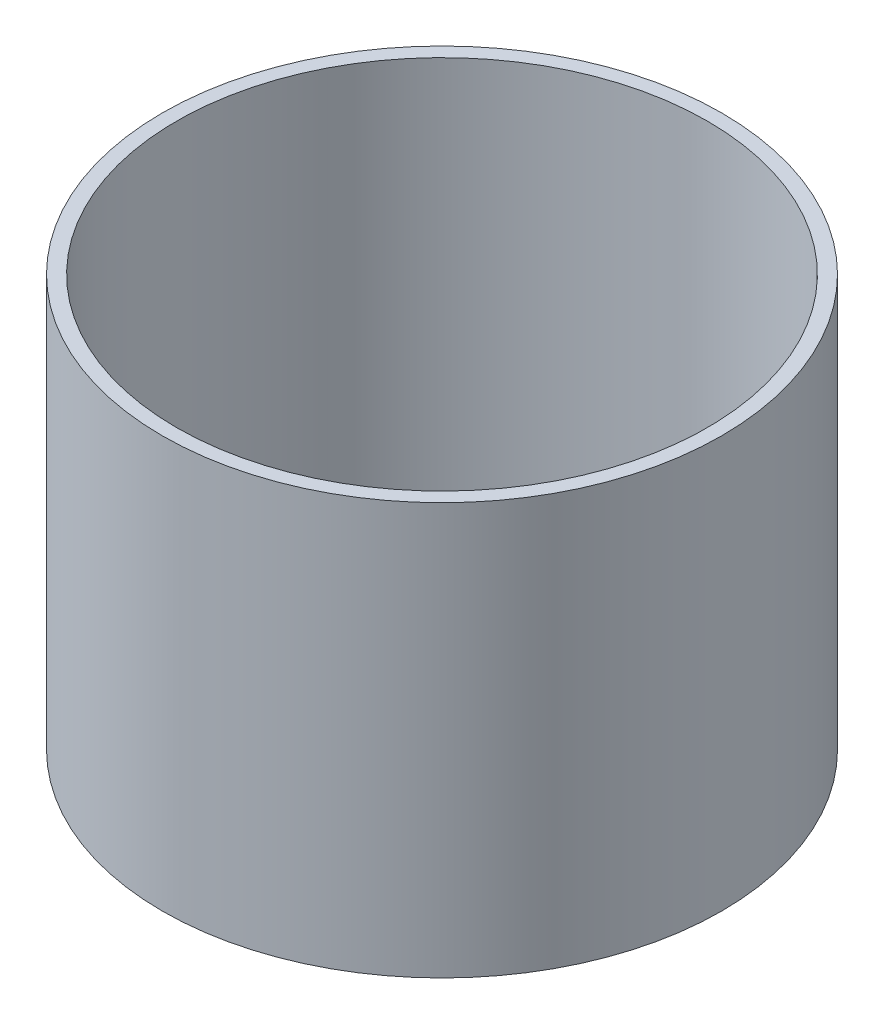
ISO-10303-21;
HEADER;
FILE_DESCRIPTION(('STEP AP214'),'2;1');
FILE_NAME('part.step','',(''),(''),'','','');
FILE_SCHEMA(('AUTOMOTIVE_DESIGN { 1 0 10303 214 1 1 1 1 }'));
ENDSEC;
DATA;
#1=APPLICATION_CONTEXT('core data for automotive mechanical design processes');
#2=APPLICATION_PROTOCOL_DEFINITION('international standard','automotive_design',2000,#1);
#3=PRODUCT_CONTEXT('',#1,'mechanical');
#4=PRODUCT('Part','Part','',(#3));
#5=PRODUCT_RELATED_PRODUCT_CATEGORY('part','',(#4));
#6=PRODUCT_DEFINITION_FORMATION('','',#4);
#7=PRODUCT_DEFINITION_CONTEXT('part definition',#1,'design');
#8=PRODUCT_DEFINITION('design','',#6,#7);
#9=PRODUCT_DEFINITION_SHAPE('','',#8);
#10=(LENGTH_UNIT() NAMED_UNIT(*) SI_UNIT(.MILLI.,.METRE.));
#11=(NAMED_UNIT(*) PLANE_ANGLE_UNIT() SI_UNIT($,.RADIAN.));
#12=(NAMED_UNIT(*) SI_UNIT($,.STERADIAN.) SOLID_ANGLE_UNIT());
#13=UNCERTAINTY_MEASURE_WITH_UNIT(LENGTH_MEASURE(1.E-05),#10,'distance_accuracy_value','');
#14=(GEOMETRIC_REPRESENTATION_CONTEXT(3) GLOBAL_UNCERTAINTY_ASSIGNED_CONTEXT((#13)) GLOBAL_UNIT_ASSIGNED_CONTEXT((#10,
#11,#12)) REPRESENTATION_CONTEXT('',''));
#15=CARTESIAN_POINT('',(0.,0.,0.));
#16=DIRECTION('',(0.,0.,1.));
#17=DIRECTION('',(1.,0.,0.));
#18=AXIS2_PLACEMENT_3D('',#15,#16,#17);
#19=CARTESIAN_POINT('',(0.,68.92544,0.));
#20=DIRECTION('',(0.,1.,0.));
#21=DIRECTION('',(0.,0.,1.));
#22=AXIS2_PLACEMENT_3D('',#19,#20,#21);
#23=PLANE('',#22);
#24=CARTESIAN_POINT('',(0.,68.92544,0.));
#25=DIRECTION('',(0.,1.,0.));
#26=DIRECTION('',(0.,0.,1.));
#27=AXIS2_PLACEMENT_3D('',#24,#25,#26);
#28=CIRCLE('',#27,93.6625);
#29=CARTESIAN_POINT('',(0.,68.92544,93.6625));
#30=VERTEX_POINT('',#29);
#31=EDGE_CURVE('E10',#30,#30,#28,.T.);
#32=ORIENTED_EDGE('',*,*,#31,.T.);
#33=EDGE_LOOP('',(#32));
#34=FACE_BOUND('',#33,.T.);
#35=CARTESIAN_POINT('',(0.,68.92544,0.));
#36=DIRECTION('',(0.,1.,0.));
#37=DIRECTION('',(0.,0.,1.));
#38=AXIS2_PLACEMENT_3D('',#35,#36,#37);
#39=CIRCLE('',#38,88.9);
#40=CARTESIAN_POINT('',(0.,68.92544,88.9));
#41=VERTEX_POINT('',#40);
#42=EDGE_CURVE('E43',#41,#41,#39,.T.);
#43=ORIENTED_EDGE('',*,*,#42,.F.);
#44=EDGE_LOOP('',(#43));
#45=FACE_BOUND('',#44,.T.);
#46=ADVANCED_FACE('F32',(#34,#45),#23,.T.);
#47=CARTESIAN_POINT('',(0.,-68.92544,0.));
#48=DIRECTION('',(0.,1.,0.));
#49=DIRECTION('',(0.,0.,1.));
#50=AXIS2_PLACEMENT_3D('',#47,#48,#49);
#51=PLANE('',#50);
#52=CARTESIAN_POINT('',(0.,-68.92544,0.));
#53=DIRECTION('',(0.,1.,0.));
#54=DIRECTION('',(0.,0.,1.));
#55=AXIS2_PLACEMENT_3D('',#52,#53,#54);
#56=CIRCLE('',#55,93.6625);
#57=CARTESIAN_POINT('',(0.,-68.92544,93.6625));
#58=VERTEX_POINT('',#57);
#59=EDGE_CURVE('E36',#58,#58,#56,.T.);
#60=ORIENTED_EDGE('',*,*,#59,.F.);
#61=EDGE_LOOP('',(#60));
#62=FACE_BOUND('',#61,.T.);
#63=CARTESIAN_POINT('',(0.,-68.92544,0.));
#64=DIRECTION('',(0.,1.,0.));
#65=DIRECTION('',(0.,0.,1.));
#66=AXIS2_PLACEMENT_3D('',#63,#64,#65);
#67=CIRCLE('',#66,88.9);
#68=CARTESIAN_POINT('',(0.,-68.92544,88.9));
#69=VERTEX_POINT('',#68);
#70=EDGE_CURVE('E45',#69,#69,#67,.T.);
#71=ORIENTED_EDGE('',*,*,#70,.T.);
#72=EDGE_LOOP('',(#71));
#73=FACE_BOUND('',#72,.T.);
#74=ADVANCED_FACE('F55',(#62,#73),#51,.F.);
#75=CARTESIAN_POINT('',(0.,68.92544,0.));
#76=DIRECTION('',(0.,-1.,0.));
#77=DIRECTION('',(0.,0.,-1.));
#78=AXIS2_PLACEMENT_3D('',#75,#76,#77);
#79=CYLINDRICAL_SURFACE('',#78,93.6625);
#80=ORIENTED_EDGE('',*,*,#31,.F.);
#81=EDGE_LOOP('',(#80));
#82=FACE_BOUND('',#81,.T.);
#83=ORIENTED_EDGE('',*,*,#59,.T.);
#84=EDGE_LOOP('',(#83));
#85=FACE_BOUND('',#84,.T.);
#86=ADVANCED_FACE('F34',(#82,#85),#79,.T.);
#87=CARTESIAN_POINT('',(0.,68.92544,0.));
#88=DIRECTION('',(0.,-1.,0.));
#89=DIRECTION('',(0.,0.,-1.));
#90=AXIS2_PLACEMENT_3D('',#87,#88,#89);
#91=CYLINDRICAL_SURFACE('',#90,88.9);
#92=ORIENTED_EDGE('',*,*,#42,.T.);
#93=EDGE_LOOP('',(#92));
#94=FACE_BOUND('',#93,.T.);
#95=ORIENTED_EDGE('',*,*,#70,.F.);
#96=EDGE_LOOP('',(#95));
#97=FACE_BOUND('',#96,.T.);
#98=ADVANCED_FACE('F51',(#94,#97),#91,.F.);
#99=CLOSED_SHELL('',(#46,#74,#86,#98));
#100=MANIFOLD_SOLID_BREP('B2',#99);
#101=ADVANCED_BREP_SHAPE_REPRESENTATION('',(#18,#100),#14);
#102=SHAPE_DEFINITION_REPRESENTATION(#9,#101);
ENDSEC;
END-ISO-10303-21;
